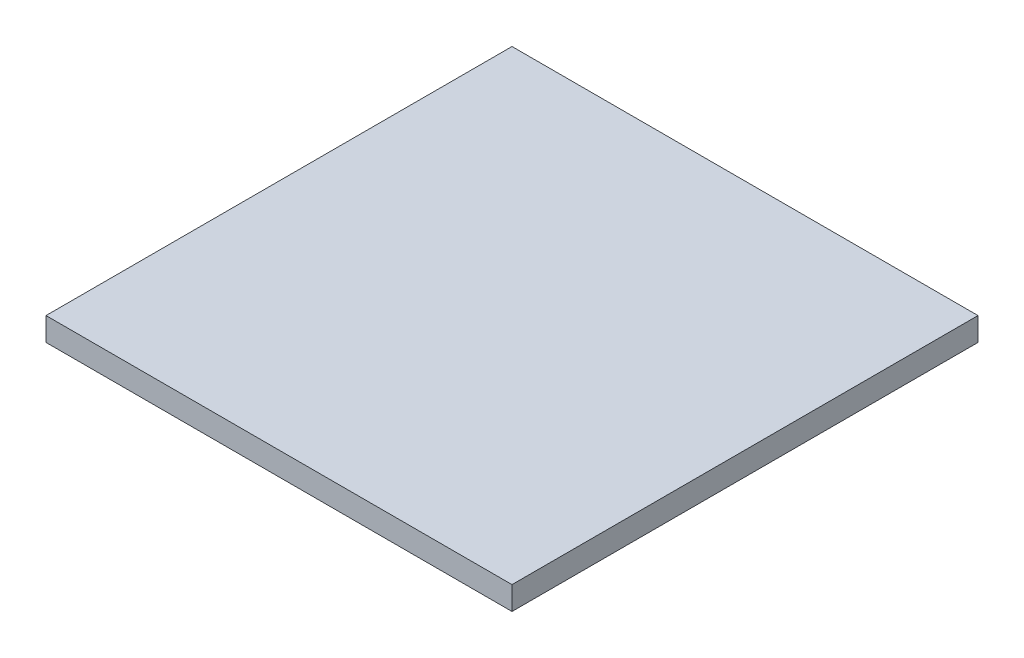
ISO-10303-21;
HEADER;
FILE_DESCRIPTION(('STEP AP214'),'2;1');
FILE_NAME('part.step','',(''),(''),'','','');
FILE_SCHEMA(('AUTOMOTIVE_DESIGN { 1 0 10303 214 1 1 1 1 }'));
ENDSEC;
DATA;
#1=APPLICATION_CONTEXT('core data for automotive mechanical design processes');
#2=APPLICATION_PROTOCOL_DEFINITION('international standard','automotive_design',2000,#1);
#3=PRODUCT_CONTEXT('',#1,'mechanical');
#4=PRODUCT('Part','Part','',(#3));
#5=PRODUCT_RELATED_PRODUCT_CATEGORY('part','',(#4));
#6=PRODUCT_DEFINITION_FORMATION('','',#4);
#7=PRODUCT_DEFINITION_CONTEXT('part definition',#1,'design');
#8=PRODUCT_DEFINITION('design','',#6,#7);
#9=PRODUCT_DEFINITION_SHAPE('','',#8);
#10=(LENGTH_UNIT() NAMED_UNIT(*) SI_UNIT(.MILLI.,.METRE.));
#11=(NAMED_UNIT(*) PLANE_ANGLE_UNIT() SI_UNIT($,.RADIAN.));
#12=(NAMED_UNIT(*) SI_UNIT($,.STERADIAN.) SOLID_ANGLE_UNIT());
#13=UNCERTAINTY_MEASURE_WITH_UNIT(LENGTH_MEASURE(1.E-05),#10,'distance_accuracy_value','');
#14=(GEOMETRIC_REPRESENTATION_CONTEXT(3) GLOBAL_UNCERTAINTY_ASSIGNED_CONTEXT((#13)) GLOBAL_UNIT_ASSIGNED_CONTEXT((#10,
#11,#12)) REPRESENTATION_CONTEXT('',''));
#15=CARTESIAN_POINT('',(0.,0.,0.));
#16=DIRECTION('',(0.,0.,1.));
#17=DIRECTION('',(1.,0.,0.));
#18=AXIS2_PLACEMENT_3D('',#15,#16,#17);
#19=CARTESIAN_POINT('',(-200.,20.,200.));
#20=DIRECTION('',(0.,0.,-1.));
#21=DIRECTION('',(-1.,0.,0.));
#22=AXIS2_PLACEMENT_3D('',#19,#20,#21);
#23=PLANE('',#22);
#24=DIRECTION('',(1.,0.,0.));
#25=VECTOR('',#24,1.);
#26=CARTESIAN_POINT('',(-200.,0.,200.));
#27=LINE('',#26,#25);
#28=CARTESIAN_POINT('',(-200.,0.,200.));
#29=VERTEX_POINT('',#28);
#30=CARTESIAN_POINT('',(200.,0.,200.));
#31=VERTEX_POINT('',#30);
#32=EDGE_CURVE('E98',#29,#31,#27,.T.);
#33=ORIENTED_EDGE('',*,*,#32,.T.);
#34=DIRECTION('',(0.,-1.,0.));
#35=VECTOR('',#34,1.);
#36=CARTESIAN_POINT('',(200.,20.,200.));
#37=LINE('',#36,#35);
#38=CARTESIAN_POINT('',(200.,20.,200.));
#39=VERTEX_POINT('',#38);
#40=EDGE_CURVE('E11',#39,#31,#37,.T.);
#41=ORIENTED_EDGE('',*,*,#40,.F.);
#42=DIRECTION('',(1.,0.,0.));
#43=VECTOR('',#42,1.);
#44=CARTESIAN_POINT('',(-200.,20.,200.));
#45=LINE('',#44,#43);
#46=CARTESIAN_POINT('',(-200.,20.,200.));
#47=VERTEX_POINT('',#46);
#48=EDGE_CURVE('E84',#47,#39,#45,.T.);
#49=ORIENTED_EDGE('',*,*,#48,.F.);
#50=DIRECTION('',(0.,-1.,0.));
#51=VECTOR('',#50,1.);
#52=CARTESIAN_POINT('',(-200.,20.,200.));
#53=LINE('',#52,#51);
#54=EDGE_CURVE('E51',#47,#29,#53,.T.);
#55=ORIENTED_EDGE('',*,*,#54,.T.);
#56=EDGE_LOOP('',(#33,#41,#49,#55));
#57=FACE_BOUND('',#56,.T.);
#58=ADVANCED_FACE('F35',(#57),#23,.F.);
#59=CARTESIAN_POINT('',(200.,20.,200.));
#60=DIRECTION('',(-1.,0.,0.));
#61=DIRECTION('',(0.,0.,1.));
#62=AXIS2_PLACEMENT_3D('',#59,#60,#61);
#63=PLANE('',#62);
#64=DIRECTION('',(0.,0.,-1.));
#65=VECTOR('',#64,1.);
#66=CARTESIAN_POINT('',(200.,0.,200.));
#67=LINE('',#66,#65);
#68=CARTESIAN_POINT('',(200.,0.,-200.));
#69=VERTEX_POINT('',#68);
#70=EDGE_CURVE('E89',#31,#69,#67,.T.);
#71=ORIENTED_EDGE('',*,*,#70,.T.);
#72=DIRECTION('',(0.,-1.,0.));
#73=VECTOR('',#72,1.);
#74=CARTESIAN_POINT('',(200.,20.,-200.));
#75=LINE('',#74,#73);
#76=CARTESIAN_POINT('',(200.,20.,-200.));
#77=VERTEX_POINT('',#76);
#78=EDGE_CURVE('E43',#77,#69,#75,.T.);
#79=ORIENTED_EDGE('',*,*,#78,.F.);
#80=DIRECTION('',(0.,0.,-1.));
#81=VECTOR('',#80,1.);
#82=CARTESIAN_POINT('',(200.,20.,200.));
#83=LINE('',#82,#81);
#84=EDGE_CURVE('E76',#39,#77,#83,.T.);
#85=ORIENTED_EDGE('',*,*,#84,.F.);
#86=ORIENTED_EDGE('',*,*,#40,.T.);
#87=EDGE_LOOP('',(#71,#79,#85,#86));
#88=FACE_BOUND('',#87,.T.);
#89=ADVANCED_FACE('F88',(#88),#63,.F.);
#90=CARTESIAN_POINT('',(-200.,20.,-200.));
#91=DIRECTION('',(0.,0.,-1.));
#92=DIRECTION('',(-1.,0.,0.));
#93=AXIS2_PLACEMENT_3D('',#90,#91,#92);
#94=PLANE('',#93);
#95=DIRECTION('',(1.,0.,0.));
#96=VECTOR('',#95,1.);
#97=CARTESIAN_POINT('',(-200.,0.,-200.));
#98=LINE('',#97,#96);
#99=CARTESIAN_POINT('',(-200.,0.,-200.));
#100=VERTEX_POINT('',#99);
#101=EDGE_CURVE('E101',#100,#69,#98,.T.);
#102=ORIENTED_EDGE('',*,*,#101,.F.);
#103=DIRECTION('',(0.,-1.,0.));
#104=VECTOR('',#103,1.);
#105=CARTESIAN_POINT('',(-200.,20.,-200.));
#106=LINE('',#105,#104);
#107=CARTESIAN_POINT('',(-200.,20.,-200.));
#108=VERTEX_POINT('',#107);
#109=EDGE_CURVE('E65',#108,#100,#106,.T.);
#110=ORIENTED_EDGE('',*,*,#109,.F.);
#111=DIRECTION('',(1.,0.,0.));
#112=VECTOR('',#111,1.);
#113=CARTESIAN_POINT('',(-200.,20.,-200.));
#114=LINE('',#113,#112);
#115=EDGE_CURVE('E83',#108,#77,#114,.T.);
#116=ORIENTED_EDGE('',*,*,#115,.T.);
#117=ORIENTED_EDGE('',*,*,#78,.T.);
#118=EDGE_LOOP('',(#102,#110,#116,#117));
#119=FACE_BOUND('',#118,.T.);
#120=ADVANCED_FACE('F92',(#119),#94,.T.);
#121=CARTESIAN_POINT('',(-200.,20.,200.));
#122=DIRECTION('',(-1.,0.,0.));
#123=DIRECTION('',(0.,0.,1.));
#124=AXIS2_PLACEMENT_3D('',#121,#122,#123);
#125=PLANE('',#124);
#126=DIRECTION('',(0.,0.,-1.));
#127=VECTOR('',#126,1.);
#128=CARTESIAN_POINT('',(-200.,0.,200.));
#129=LINE('',#128,#127);
#130=EDGE_CURVE('E103',#29,#100,#129,.T.);
#131=ORIENTED_EDGE('',*,*,#130,.F.);
#132=ORIENTED_EDGE('',*,*,#54,.F.);
#133=DIRECTION('',(0.,0.,-1.));
#134=VECTOR('',#133,1.);
#135=CARTESIAN_POINT('',(-200.,20.,200.));
#136=LINE('',#135,#134);
#137=EDGE_CURVE('E93',#47,#108,#136,.T.);
#138=ORIENTED_EDGE('',*,*,#137,.T.);
#139=ORIENTED_EDGE('',*,*,#109,.T.);
#140=EDGE_LOOP('',(#131,#132,#138,#139));
#141=FACE_BOUND('',#140,.T.);
#142=ADVANCED_FACE('F109',(#141),#125,.T.);
#143=CARTESIAN_POINT('',(0.,20.,0.));
#144=DIRECTION('',(0.,1.,0.));
#145=DIRECTION('',(0.,0.,1.));
#146=AXIS2_PLACEMENT_3D('',#143,#144,#145);
#147=PLANE('',#146);
#148=ORIENTED_EDGE('',*,*,#48,.T.);
#149=ORIENTED_EDGE('',*,*,#84,.T.);
#150=ORIENTED_EDGE('',*,*,#115,.F.);
#151=ORIENTED_EDGE('',*,*,#137,.F.);
#152=EDGE_LOOP('',(#148,#149,#150,#151));
#153=FACE_BOUND('',#152,.T.);
#154=ADVANCED_FACE('F80',(#153),#147,.T.);
#155=CARTESIAN_POINT('',(0.,0.,0.));
#156=DIRECTION('',(0.,1.,0.));
#157=DIRECTION('',(0.,0.,1.));
#158=AXIS2_PLACEMENT_3D('',#155,#156,#157);
#159=PLANE('',#158);
#160=ORIENTED_EDGE('',*,*,#32,.F.);
#161=ORIENTED_EDGE('',*,*,#130,.T.);
#162=ORIENTED_EDGE('',*,*,#101,.T.);
#163=ORIENTED_EDGE('',*,*,#70,.F.);
#164=EDGE_LOOP('',(#160,#161,#162,#163));
#165=FACE_BOUND('',#164,.T.);
#166=ADVANCED_FACE('F108',(#165),#159,.F.);
#167=CLOSED_SHELL('',(#58,#89,#120,#142,#154,#166));
#168=MANIFOLD_SOLID_BREP('B2',#167);
#169=ADVANCED_BREP_SHAPE_REPRESENTATION('',(#18,#168),#14);
#170=SHAPE_DEFINITION_REPRESENTATION(#9,#169);
ENDSEC;
END-ISO-10303-21;
